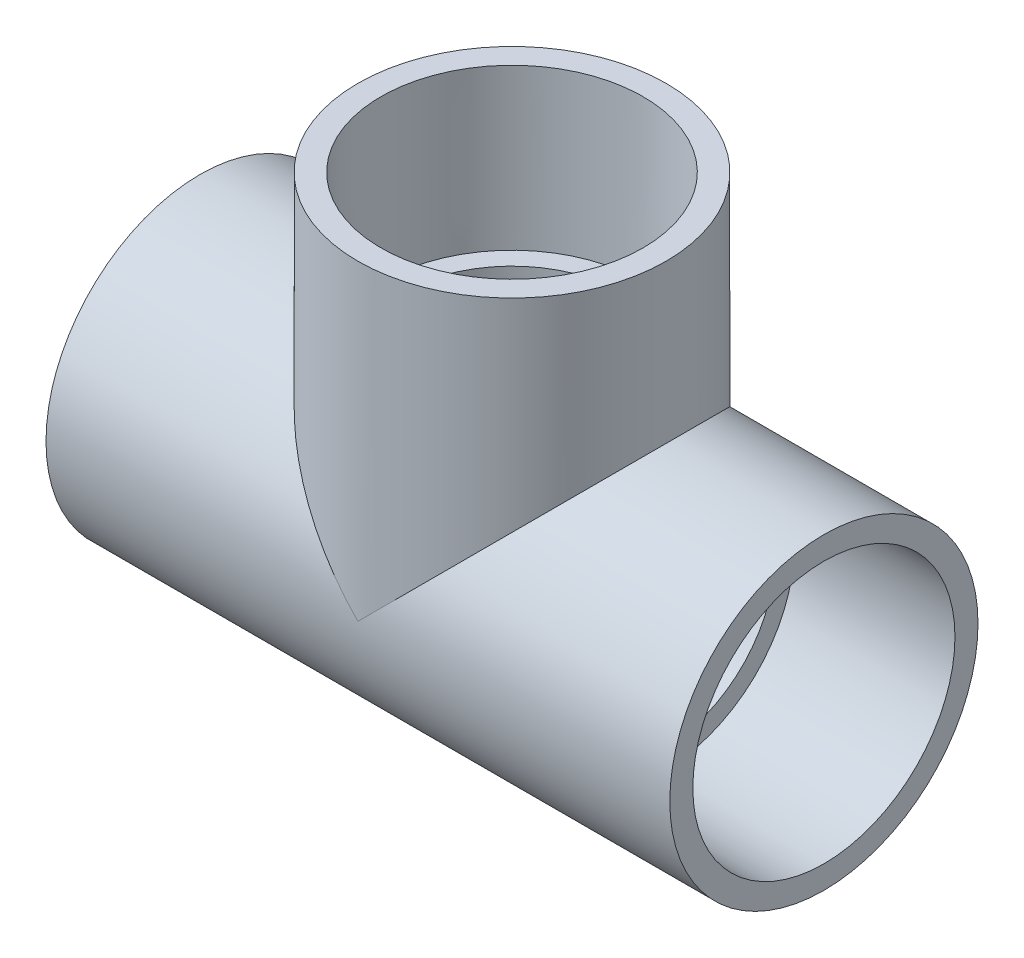
ISO-10303-21;
HEADER;
FILE_DESCRIPTION(('STEP AP214'),'2;1');
FILE_NAME('part.step','',(''),(''),'','','');
FILE_SCHEMA(('AUTOMOTIVE_DESIGN { 1 0 10303 214 1 1 1 1 }'));
ENDSEC;
DATA;
#1=APPLICATION_CONTEXT('core data for automotive mechanical design processes');
#2=APPLICATION_PROTOCOL_DEFINITION('international standard','automotive_design',2000,#1);
#3=PRODUCT_CONTEXT('',#1,'mechanical');
#4=PRODUCT('Part','Part','',(#3));
#5=PRODUCT_RELATED_PRODUCT_CATEGORY('part','',(#4));
#6=PRODUCT_DEFINITION_FORMATION('','',#4);
#7=PRODUCT_DEFINITION_CONTEXT('part definition',#1,'design');
#8=PRODUCT_DEFINITION('design','',#6,#7);
#9=PRODUCT_DEFINITION_SHAPE('','',#8);
#10=(LENGTH_UNIT() NAMED_UNIT(*) SI_UNIT(.MILLI.,.METRE.));
#11=(NAMED_UNIT(*) PLANE_ANGLE_UNIT() SI_UNIT($,.RADIAN.));
#12=(NAMED_UNIT(*) SI_UNIT($,.STERADIAN.) SOLID_ANGLE_UNIT());
#13=UNCERTAINTY_MEASURE_WITH_UNIT(LENGTH_MEASURE(1.E-05),#10,'distance_accuracy_value','');
#14=(GEOMETRIC_REPRESENTATION_CONTEXT(3) GLOBAL_UNCERTAINTY_ASSIGNED_CONTEXT((#13)) GLOBAL_UNIT_ASSIGNED_CONTEXT((#10,
#11,#12)) REPRESENTATION_CONTEXT('',''));
#15=CARTESIAN_POINT('',(0.,0.,0.));
#16=DIRECTION('',(0.,0.,1.));
#17=DIRECTION('',(1.,0.,0.));
#18=AXIS2_PLACEMENT_3D('',#15,#16,#17);
#19=CARTESIAN_POINT('',(-28.2702,0.,0.));
#20=DIRECTION('',(1.,0.,0.));
#21=DIRECTION('',(0.,0.,-1.));
#22=AXIS2_PLACEMENT_3D('',#19,#20,#21);
#23=PLANE('',#22);
#24=CARTESIAN_POINT('',(-28.2702,0.,0.));
#25=DIRECTION('',(-1.,0.,0.));
#26=DIRECTION('',(0.,0.,1.));
#27=AXIS2_PLACEMENT_3D('',#24,#25,#26);
#28=CIRCLE('',#27,24.0538);
#29=CARTESIAN_POINT('',(-28.2702,0.,24.0538));
#30=VERTEX_POINT('',#29);
#31=EDGE_CURVE('E93',#30,#30,#28,.T.);
#32=ORIENTED_EDGE('',*,*,#31,.T.);
#33=EDGE_LOOP('',(#32));
#34=FACE_BOUND('',#33,.T.);
#35=CARTESIAN_POINT('',(-28.2702,0.,0.));
#36=DIRECTION('',(1.,0.,0.));
#37=DIRECTION('',(0.,0.,-1.));
#38=AXIS2_PLACEMENT_3D('',#35,#36,#37);
#39=CIRCLE('',#38,20.447);
#40=CARTESIAN_POINT('',(-28.2702,0.,-20.447));
#41=VERTEX_POINT('',#40);
#42=EDGE_CURVE('E76',#41,#41,#39,.T.);
#43=ORIENTED_EDGE('',*,*,#42,.T.);
#44=EDGE_LOOP('',(#43));
#45=FACE_BOUND('',#44,.T.);
#46=ADVANCED_FACE('F37',(#34,#45),#23,.F.);
#47=CARTESIAN_POINT('',(28.2702,0.,0.));
#48=DIRECTION('',(1.,0.,0.));
#49=DIRECTION('',(0.,0.,-1.));
#50=AXIS2_PLACEMENT_3D('',#47,#48,#49);
#51=PLANE('',#50);
#52=CARTESIAN_POINT('',(28.2702,0.,0.));
#53=DIRECTION('',(1.,0.,0.));
#54=DIRECTION('',(0.,0.,-1.));
#55=AXIS2_PLACEMENT_3D('',#52,#53,#54);
#56=CIRCLE('',#55,20.447);
#57=CARTESIAN_POINT('',(28.2702,0.,-20.447));
#58=VERTEX_POINT('',#57);
#59=EDGE_CURVE('E73',#58,#58,#56,.T.);
#60=ORIENTED_EDGE('',*,*,#59,.F.);
#61=EDGE_LOOP('',(#60));
#62=FACE_BOUND('',#61,.T.);
#63=CARTESIAN_POINT('',(28.2702,0.,0.));
#64=DIRECTION('',(1.,0.,0.));
#65=DIRECTION('',(0.,0.,-1.));
#66=AXIS2_PLACEMENT_3D('',#63,#64,#65);
#67=CIRCLE('',#66,24.0538);
#68=CARTESIAN_POINT('',(28.2702,0.,-24.0538));
#69=VERTEX_POINT('',#68);
#70=EDGE_CURVE('E64',#69,#69,#67,.F.);
#71=ORIENTED_EDGE('',*,*,#70,.F.);
#72=EDGE_LOOP('',(#71));
#73=FACE_BOUND('',#72,.T.);
#74=ADVANCED_FACE('F115',(#62,#73),#51,.T.);
#75=CARTESIAN_POINT('',(28.2702,0.,0.));
#76=DIRECTION('',(-1.,0.,0.));
#77=DIRECTION('',(0.,0.,1.));
#78=AXIS2_PLACEMENT_3D('',#75,#76,#77);
#79=CYLINDRICAL_SURFACE('',#78,28.5496);
#80=CARTESIAN_POINT('',(-57.785,0.,0.));
#81=DIRECTION('',(-1.,0.,0.));
#82=DIRECTION('',(0.,0.,1.));
#83=AXIS2_PLACEMENT_3D('',#80,#81,#82);
#84=CIRCLE('',#83,28.5496);
#85=CARTESIAN_POINT('',(-57.785,0.,28.5496));
#86=VERTEX_POINT('',#85);
#87=EDGE_CURVE('E90',#86,#86,#84,.T.);
#88=ORIENTED_EDGE('',*,*,#87,.F.);
#89=EDGE_LOOP('',(#88));
#90=FACE_BOUND('',#89,.T.);
#91=CARTESIAN_POINT('',(57.785,0.,0.));
#92=DIRECTION('',(-1.,0.,0.));
#93=DIRECTION('',(0.,0.,1.));
#94=AXIS2_PLACEMENT_3D('',#91,#92,#93);
#95=CIRCLE('',#94,28.5496);
#96=CARTESIAN_POINT('',(57.785,0.,28.5496));
#97=VERTEX_POINT('',#96);
#98=EDGE_CURVE('E78',#97,#97,#95,.T.);
#99=ORIENTED_EDGE('',*,*,#98,.T.);
#100=EDGE_LOOP('',(#99));
#101=FACE_BOUND('',#100,.T.);
#102=CARTESIAN_POINT('',(0.,0.,0.));
#103=DIRECTION('',(-0.707106781186547,-0.707106781186547,0.));
#104=DIRECTION('',(0.707106781186547,-0.707106781186547,0.));
#105=AXIS2_PLACEMENT_3D('',#102,#103,#104);
#106=ELLIPSE('',#105,40.3752315203269,28.5496);
#107=CARTESIAN_POINT('',(0.,0.,28.5496));
#108=VERTEX_POINT('',#107);
#109=CARTESIAN_POINT('',(0.,0.,-28.5496));
#110=VERTEX_POINT('',#109);
#111=EDGE_CURVE('E99',#108,#110,#106,.T.);
#112=ORIENTED_EDGE('',*,*,#111,.T.);
#113=CARTESIAN_POINT('',(0.,0.,0.));
#114=DIRECTION('',(0.707106781186547,-0.707106781186547,0.));
#115=DIRECTION('',(-0.707106781186547,-0.707106781186547,0.));
#116=AXIS2_PLACEMENT_3D('',#113,#114,#115);
#117=ELLIPSE('',#116,40.3752315203269,28.5496);
#118=EDGE_CURVE('E56',#110,#108,#117,.T.);
#119=ORIENTED_EDGE('',*,*,#118,.T.);
#120=EDGE_LOOP('',(#112,#119));
#121=FACE_BOUND('',#120,.T.);
#122=ADVANCED_FACE('F117',(#90,#101,#121),#79,.T.);
#123=CARTESIAN_POINT('',(-28.2702,0.,0.));
#124=DIRECTION('',(-1.,0.,0.));
#125=DIRECTION('',(0.,0.,1.));
#126=AXIS2_PLACEMENT_3D('',#123,#124,#125);
#127=CONICAL_SURFACE('',#126,24.0538,0.0077451119096428);
#128=CARTESIAN_POINT('',(-57.785,0.,0.));
#129=DIRECTION('',(-1.,0.,0.));
#130=DIRECTION('',(0.,0.,1.));
#131=AXIS2_PLACEMENT_3D('',#128,#129,#130);
#132=CIRCLE('',#131,24.2824);
#133=CARTESIAN_POINT('',(-57.785,0.,24.2824));
#134=VERTEX_POINT('',#133);
#135=EDGE_CURVE('E96',#134,#134,#132,.T.);
#136=ORIENTED_EDGE('',*,*,#135,.T.);
#137=EDGE_LOOP('',(#136));
#138=FACE_BOUND('',#137,.T.);
#139=ORIENTED_EDGE('',*,*,#31,.F.);
#140=EDGE_LOOP('',(#139));
#141=FACE_BOUND('',#140,.T.);
#142=ADVANCED_FACE('F124',(#138,#141),#127,.F.);
#143=CARTESIAN_POINT('',(57.785,0.,0.));
#144=DIRECTION('',(1.,0.,0.));
#145=DIRECTION('',(0.,0.,-1.));
#146=AXIS2_PLACEMENT_3D('',#143,#144,#145);
#147=CONICAL_SURFACE('',#146,24.2824,0.00774511190964257);
#148=CARTESIAN_POINT('',(57.785,0.,0.));
#149=DIRECTION('',(-1.,0.,0.));
#150=DIRECTION('',(0.,0.,1.));
#151=AXIS2_PLACEMENT_3D('',#148,#149,#150);
#152=CIRCLE('',#151,24.2824);
#153=CARTESIAN_POINT('',(57.785,0.,24.2824));
#154=VERTEX_POINT('',#153);
#155=EDGE_CURVE('E81',#154,#154,#152,.T.);
#156=ORIENTED_EDGE('',*,*,#155,.F.);
#157=EDGE_LOOP('',(#156));
#158=FACE_BOUND('',#157,.T.);
#159=ORIENTED_EDGE('',*,*,#70,.T.);
#160=EDGE_LOOP('',(#159));
#161=FACE_BOUND('',#160,.T.);
#162=ADVANCED_FACE('F113',(#158,#161),#147,.F.);
#163=CARTESIAN_POINT('',(0.,57.785,0.));
#164=DIRECTION('',(0.,1.,0.));
#165=DIRECTION('',(-1.,0.,0.));
#166=AXIS2_PLACEMENT_3D('',#163,#164,#165);
#167=CONICAL_SURFACE('',#166,24.2824,0.0077451119096428);
#168=CARTESIAN_POINT('',(0.,57.785,0.));
#169=DIRECTION('',(0.,-1.,0.));
#170=DIRECTION('',(1.,0.,0.));
#171=AXIS2_PLACEMENT_3D('',#168,#169,#170);
#172=CIRCLE('',#171,24.2824);
#173=CARTESIAN_POINT('',(24.2824,57.785,0.));
#174=VERTEX_POINT('',#173);
#175=EDGE_CURVE('E101',#174,#174,#172,.T.);
#176=ORIENTED_EDGE('',*,*,#175,.F.);
#177=EDGE_LOOP('',(#176));
#178=FACE_BOUND('',#177,.T.);
#179=CARTESIAN_POINT('',(0.,28.2702,0.));
#180=DIRECTION('',(0.,-1.,0.));
#181=DIRECTION('',(1.,0.,0.));
#182=AXIS2_PLACEMENT_3D('',#179,#180,#181);
#183=CIRCLE('',#182,24.0538);
#184=CARTESIAN_POINT('',(24.0538,28.2702,0.));
#185=VERTEX_POINT('',#184);
#186=EDGE_CURVE('E104',#185,#185,#183,.T.);
#187=ORIENTED_EDGE('',*,*,#186,.T.);
#188=EDGE_LOOP('',(#187));
#189=FACE_BOUND('',#188,.T.);
#190=ADVANCED_FACE('F133',(#178,#189),#167,.F.);
#191=CARTESIAN_POINT('',(28.5496,57.785,0.));
#192=DIRECTION('',(0.,1.,0.));
#193=DIRECTION('',(-1.,0.,0.));
#194=AXIS2_PLACEMENT_3D('',#191,#192,#193);
#195=PLANE('',#194);
#196=ORIENTED_EDGE('',*,*,#175,.T.);
#197=EDGE_LOOP('',(#196));
#198=FACE_BOUND('',#197,.T.);
#199=CARTESIAN_POINT('',(0.,57.785,0.));
#200=DIRECTION('',(0.,-1.,0.));
#201=DIRECTION('',(1.,0.,0.));
#202=AXIS2_PLACEMENT_3D('',#199,#200,#201);
#203=CIRCLE('',#202,28.5496);
#204=CARTESIAN_POINT('',(28.5496,57.785,0.));
#205=VERTEX_POINT('',#204);
#206=EDGE_CURVE('E107',#205,#205,#203,.T.);
#207=ORIENTED_EDGE('',*,*,#206,.F.);
#208=EDGE_LOOP('',(#207));
#209=FACE_BOUND('',#208,.T.);
#210=ADVANCED_FACE('F39',(#198,#209),#195,.T.);
#211=CARTESIAN_POINT('',(0.,0.,0.));
#212=DIRECTION('',(0.,-1.,0.));
#213=DIRECTION('',(1.,0.,0.));
#214=AXIS2_PLACEMENT_3D('',#211,#212,#213);
#215=CYLINDRICAL_SURFACE('',#214,28.5496);
#216=ORIENTED_EDGE('',*,*,#118,.F.);
#217=ORIENTED_EDGE('',*,*,#111,.F.);
#218=EDGE_LOOP('',(#216,#217));
#219=FACE_BOUND('',#218,.T.);
#220=ORIENTED_EDGE('',*,*,#206,.T.);
#221=EDGE_LOOP('',(#220));
#222=FACE_BOUND('',#221,.T.);
#223=ADVANCED_FACE('F136',(#219,#222),#215,.T.);
#224=CARTESIAN_POINT('',(-57.785,-28.5496,0.));
#225=DIRECTION('',(-1.,0.,0.));
#226=DIRECTION('',(0.,0.,1.));
#227=AXIS2_PLACEMENT_3D('',#224,#225,#226);
#228=PLANE('',#227);
#229=ORIENTED_EDGE('',*,*,#87,.T.);
#230=EDGE_LOOP('',(#229));
#231=FACE_BOUND('',#230,.T.);
#232=ORIENTED_EDGE('',*,*,#135,.F.);
#233=EDGE_LOOP('',(#232));
#234=FACE_BOUND('',#233,.T.);
#235=ADVANCED_FACE('F130',(#231,#234),#228,.T.);
#236=CARTESIAN_POINT('',(57.785,-28.5496,0.));
#237=DIRECTION('',(1.,0.,0.));
#238=DIRECTION('',(0.,0.,-1.));
#239=AXIS2_PLACEMENT_3D('',#236,#237,#238);
#240=PLANE('',#239);
#241=ORIENTED_EDGE('',*,*,#155,.T.);
#242=EDGE_LOOP('',(#241));
#243=FACE_BOUND('',#242,.T.);
#244=ORIENTED_EDGE('',*,*,#98,.F.);
#245=EDGE_LOOP('',(#244));
#246=FACE_BOUND('',#245,.T.);
#247=ADVANCED_FACE('F142',(#243,#246),#240,.T.);
#248=CARTESIAN_POINT('',(0.,28.2702,0.));
#249=DIRECTION('',(0.,-1.,0.));
#250=DIRECTION('',(1.,0.,0.));
#251=AXIS2_PLACEMENT_3D('',#248,#249,#250);
#252=PLANE('',#251);
#253=CARTESIAN_POINT('',(0.,28.2702,0.));
#254=DIRECTION('',(0.,-1.,0.));
#255=DIRECTION('',(1.,0.,0.));
#256=AXIS2_PLACEMENT_3D('',#253,#254,#255);
#257=CIRCLE('',#256,20.447);
#258=CARTESIAN_POINT('',(20.447,28.2702,0.));
#259=VERTEX_POINT('',#258);
#260=EDGE_CURVE('E83',#259,#259,#257,.T.);
#261=ORIENTED_EDGE('',*,*,#260,.T.);
#262=EDGE_LOOP('',(#261));
#263=FACE_BOUND('',#262,.T.);
#264=ORIENTED_EDGE('',*,*,#186,.F.);
#265=EDGE_LOOP('',(#264));
#266=FACE_BOUND('',#265,.T.);
#267=ADVANCED_FACE('F68',(#263,#266),#252,.F.);
#268=CARTESIAN_POINT('',(57.785,0.,0.));
#269=DIRECTION('',(1.,0.,0.));
#270=DIRECTION('',(0.,0.,-1.));
#271=AXIS2_PLACEMENT_3D('',#268,#269,#270);
#272=CYLINDRICAL_SURFACE('',#271,20.447);
#273=CARTESIAN_POINT('',(0.,0.,0.));
#274=DIRECTION('',(0.707106781186547,-0.707106781186547,0.));
#275=DIRECTION('',(0.707106781186547,0.707106781186547,0.));
#276=AXIS2_PLACEMENT_3D('',#273,#274,#275);
#277=ELLIPSE('',#276,28.9164247098427,20.447);
#278=CARTESIAN_POINT('',(0.,0.,-20.447));
#279=VERTEX_POINT('',#278);
#280=CARTESIAN_POINT('',(0.,0.,20.447));
#281=VERTEX_POINT('',#280);
#282=EDGE_CURVE('E11',#279,#281,#277,.T.);
#283=ORIENTED_EDGE('',*,*,#282,.F.);
#284=CARTESIAN_POINT('',(0.,0.,0.));
#285=DIRECTION('',(0.707106781186547,0.707106781186547,0.));
#286=DIRECTION('',(0.707106781186547,-0.707106781186547,0.));
#287=AXIS2_PLACEMENT_3D('',#284,#285,#286);
#288=ELLIPSE('',#287,28.9164247098427,20.447);
#289=EDGE_CURVE('E45',#281,#279,#288,.F.);
#290=ORIENTED_EDGE('',*,*,#289,.F.);
#291=EDGE_LOOP('',(#283,#290));
#292=FACE_BOUND('',#291,.T.);
#293=ORIENTED_EDGE('',*,*,#59,.T.);
#294=EDGE_LOOP('',(#293));
#295=FACE_BOUND('',#294,.T.);
#296=ORIENTED_EDGE('',*,*,#42,.F.);
#297=EDGE_LOOP('',(#296));
#298=FACE_BOUND('',#297,.T.);
#299=ADVANCED_FACE('F65',(#292,#295,#298),#272,.F.);
#300=CARTESIAN_POINT('',(0.,0.,0.));
#301=DIRECTION('',(0.,-1.,0.));
#302=DIRECTION('',(1.,0.,0.));
#303=AXIS2_PLACEMENT_3D('',#300,#301,#302);
#304=CYLINDRICAL_SURFACE('',#303,20.447);
#305=ORIENTED_EDGE('',*,*,#282,.T.);
#306=ORIENTED_EDGE('',*,*,#289,.T.);
#307=EDGE_LOOP('',(#305,#306));
#308=FACE_BOUND('',#307,.T.);
#309=ORIENTED_EDGE('',*,*,#260,.F.);
#310=EDGE_LOOP('',(#309));
#311=FACE_BOUND('',#310,.T.);
#312=ADVANCED_FACE('F61',(#308,#311),#304,.F.);
#313=CLOSED_SHELL('',(#46,#74,#122,#142,#162,#190,#210,#223,#235,#247,#267,#299,#312));
#314=MANIFOLD_SOLID_BREP('B2',#313);
#315=ADVANCED_BREP_SHAPE_REPRESENTATION('',(#18,#314),#14);
#316=SHAPE_DEFINITION_REPRESENTATION(#9,#315);
ENDSEC;
END-ISO-10303-21;
